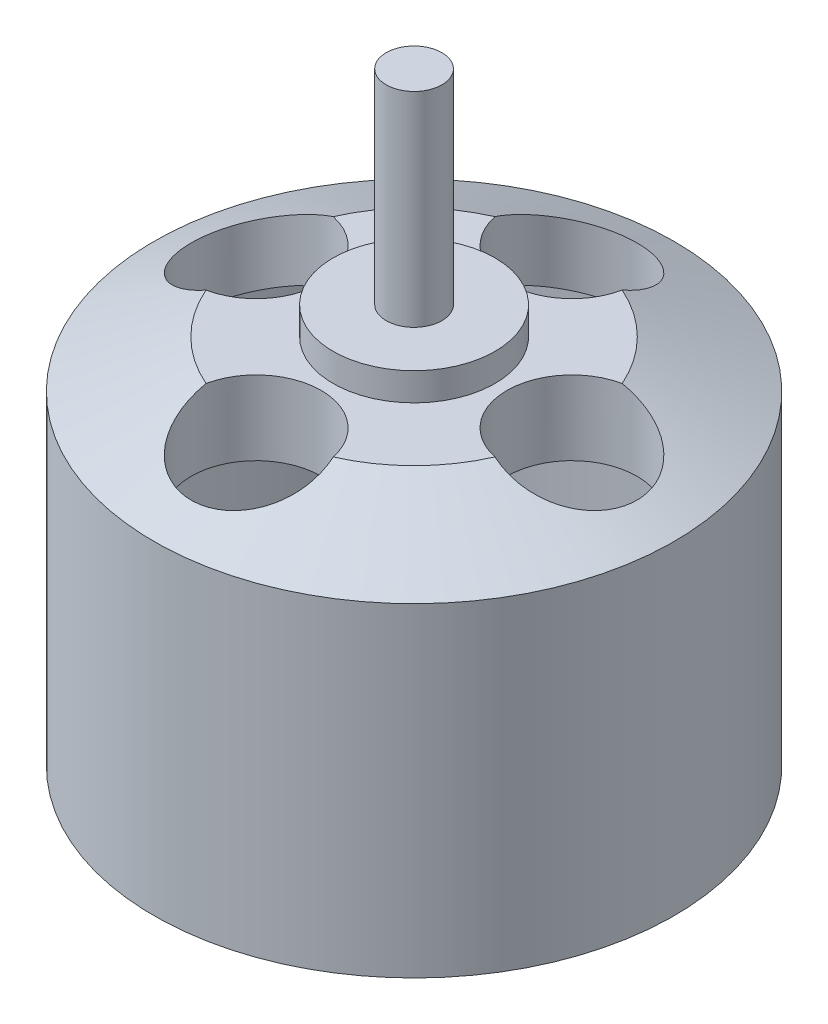
ISO-10303-21;
HEADER;
FILE_DESCRIPTION(('STEP AP214'),'2;1');
FILE_NAME('part.step','',(''),(''),'','','');
FILE_SCHEMA(('AUTOMOTIVE_DESIGN { 1 0 10303 214 1 1 1 1 }'));
ENDSEC;
DATA;
#1=APPLICATION_CONTEXT('core data for automotive mechanical design processes');
#2=APPLICATION_PROTOCOL_DEFINITION('international standard','automotive_design',2000,#1);
#3=PRODUCT_CONTEXT('',#1,'mechanical');
#4=PRODUCT('Part','Part','',(#3));
#5=PRODUCT_RELATED_PRODUCT_CATEGORY('part','',(#4));
#6=PRODUCT_DEFINITION_FORMATION('','',#4);
#7=PRODUCT_DEFINITION_CONTEXT('part definition',#1,'design');
#8=PRODUCT_DEFINITION('design','',#6,#7);
#9=PRODUCT_DEFINITION_SHAPE('','',#8);
#10=(LENGTH_UNIT() NAMED_UNIT(*) SI_UNIT(.MILLI.,.METRE.));
#11=(NAMED_UNIT(*) PLANE_ANGLE_UNIT() SI_UNIT($,.RADIAN.));
#12=(NAMED_UNIT(*) SI_UNIT($,.STERADIAN.) SOLID_ANGLE_UNIT());
#13=UNCERTAINTY_MEASURE_WITH_UNIT(LENGTH_MEASURE(1.E-05),#10,'distance_accuracy_value','');
#14=(GEOMETRIC_REPRESENTATION_CONTEXT(3) GLOBAL_UNCERTAINTY_ASSIGNED_CONTEXT((#13)) GLOBAL_UNIT_ASSIGNED_CONTEXT((#10,
#11,#12)) REPRESENTATION_CONTEXT('',''));
#15=CARTESIAN_POINT('',(0.,0.,0.));
#16=DIRECTION('',(0.,0.,1.));
#17=DIRECTION('',(1.,0.,0.));
#18=AXIS2_PLACEMENT_3D('',#15,#16,#17);
#19=CARTESIAN_POINT('',(0.,-16.,0.));
#20=DIRECTION('',(0.,-1.,0.));
#21=DIRECTION('',(0.,0.,-1.));
#22=AXIS2_PLACEMENT_3D('',#19,#20,#21);
#23=PLANE('',#22);
#24=CARTESIAN_POINT('',(0.,-16.,0.));
#25=DIRECTION('',(0.,-1.,0.));
#26=DIRECTION('',(0.,0.,-1.));
#27=AXIS2_PLACEMENT_3D('',#24,#25,#26);
#28=CIRCLE('',#27,14.);
#29=CARTESIAN_POINT('',(0.,-16.,-14.));
#30=VERTEX_POINT('',#29);
#31=EDGE_CURVE('E302',#30,#30,#28,.T.);
#32=ORIENTED_EDGE('',*,*,#31,.T.);
#33=EDGE_LOOP('',(#32));
#34=FACE_BOUND('',#33,.T.);
#35=CARTESIAN_POINT('',(0.,-16.,0.));
#36=DIRECTION('',(0.,-1.,0.));
#37=DIRECTION('',(0.,0.,-1.));
#38=AXIS2_PLACEMENT_3D('',#35,#36,#37);
#39=CIRCLE('',#38,13.24);
#40=CARTESIAN_POINT('',(0.,-16.,-13.24));
#41=VERTEX_POINT('',#40);
#42=EDGE_CURVE('E120',#41,#41,#39,.T.);
#43=ORIENTED_EDGE('',*,*,#42,.F.);
#44=EDGE_LOOP('',(#43));
#45=FACE_BOUND('',#44,.T.);
#46=ADVANCED_FACE('F41',(#34,#45),#23,.T.);
#47=CARTESIAN_POINT('',(0.,-19.4469995619799,0.));
#48=DIRECTION('',(0.,-1.,0.));
#49=DIRECTION('',(0.,0.,-1.));
#50=AXIS2_PLACEMENT_3D('',#47,#48,#49);
#51=CYLINDRICAL_SURFACE('',#50,13.24);
#52=ORIENTED_EDGE('',*,*,#42,.T.);
#53=EDGE_LOOP('',(#52));
#54=FACE_BOUND('',#53,.T.);
#55=CARTESIAN_POINT('',(0.,-1.5,0.));
#56=DIRECTION('',(0.,-1.,0.));
#57=DIRECTION('',(0.,0.,-1.));
#58=AXIS2_PLACEMENT_3D('',#55,#56,#57);
#59=CIRCLE('',#58,13.24);
#60=CARTESIAN_POINT('',(0.,-1.5,-13.24));
#61=VERTEX_POINT('',#60);
#62=EDGE_CURVE('E171',#61,#61,#59,.T.);
#63=ORIENTED_EDGE('',*,*,#62,.F.);
#64=EDGE_LOOP('',(#63));
#65=FACE_BOUND('',#64,.T.);
#66=ADVANCED_FACE('F216',(#54,#65),#51,.F.);
#67=CARTESIAN_POINT('',(0.,0.,0.));
#68=DIRECTION('',(0.,-1.,0.));
#69=DIRECTION('',(0.,0.,-1.));
#70=AXIS2_PLACEMENT_3D('',#67,#68,#69);
#71=CONICAL_SURFACE('',#70,10.,1.13721484284313);
#72=CARTESIAN_POINT('',(-3.37929158623575,0.000200000000003452,-9.41125648156611));
#73=CARTESIAN_POINT('',(-3.35362577634706,-0.0372705450020807,-9.50646778700696));
#74=CARTESIAN_POINT('',(-3.32384120358389,-0.073968704903637,-9.60088015161493));
#75=CARTESIAN_POINT('',(-3.25612758576577,-0.145676588500697,-9.78742693181489));
#76=CARTESIAN_POINT('',(-3.21819641294265,-0.180685868155294,-9.8795607452598));
#77=CARTESIAN_POINT('',(-3.13421912630061,-0.248915170060511,-10.0609862857074));
#78=CARTESIAN_POINT('',(-3.08815823538332,-0.282131787796258,-10.1502724817017));
#79=CARTESIAN_POINT('',(-2.98819466400165,-0.346540900559239,-10.3250599396943));
#80=CARTESIAN_POINT('',(-2.93429271790643,-0.377733584746693,-10.4105615551678));
#81=CARTESIAN_POINT('',(-2.76091583930015,-0.468182213917193,-10.6606581863167));
#82=CARTESIAN_POINT('',(-2.62986861558726,-0.524228548208502,-10.8186302455657));
#83=CARTESIAN_POINT('',(-2.34040485173376,-0.626392941394819,-11.1105057465168));
#84=CARTESIAN_POINT('',(-2.18201949466505,-0.672522178997262,-11.2444362598143));
#85=CARTESIAN_POINT('',(-1.85009598261013,-0.75204123719362,-11.477638516249));
#86=CARTESIAN_POINT('',(-1.67760938366938,-0.785924963047858,-11.5782356256371));
#87=CARTESIAN_POINT('',(-1.31653364392419,-0.843102591219234,-11.7490945798343));
#88=CARTESIAN_POINT('',(-1.12794388915905,-0.866396089551288,-11.8193552673957));
#89=CARTESIAN_POINT('',(-0.749821371871697,-0.901003143738591,-11.9240925330193));
#90=CARTESIAN_POINT('',(-0.560764226817224,-0.912835936020139,-11.9601185119658));
#91=CARTESIAN_POINT('',(-0.17897636761551,-0.92615464635899,-12.0006848801966));
#92=CARTESIAN_POINT('',(0.0137532463397586,-0.927643615813857,-12.0052345548974));
#93=CARTESIAN_POINT('',(0.392566635905904,-0.920337619480737,-11.9829643855682));
#94=CARTESIAN_POINT('',(0.578699454913781,-0.911786397212837,-11.9568880381974));
#95=CARTESIAN_POINT('',(0.943748726797481,-0.884978561161373,-11.8755457546804));
#96=CARTESIAN_POINT('',(1.12266470374324,-0.86672130841505,-11.8202778968143));
#97=CARTESIAN_POINT('',(1.46903805263986,-0.820783273261593,-11.6822660161879));
#98=CARTESIAN_POINT('',(1.63644979654087,-0.793067306160085,-11.5994194342811));
#99=CARTESIAN_POINT('',(1.95474639732037,-0.728772794580089,-11.4091835560685));
#100=CARTESIAN_POINT('',(2.10563278531062,-0.692195072173759,-11.3017965363404));
#101=CARTESIAN_POINT('',(2.39147614817749,-0.609655683445458,-11.0625337642482));
#102=CARTESIAN_POINT('',(2.52584274100427,-0.563452193653586,-10.9300370173085));
#103=CARTESIAN_POINT('',(2.77050500992041,-0.463166561738001,-10.6469380252733));
#104=CARTESIAN_POINT('',(2.88078497910145,-0.409079316707625,-10.4963240645938));
#105=CARTESIAN_POINT('',(3.06785527360667,-0.298274915674711,-10.1933743912214));
#106=CARTESIAN_POINT('',(3.14654271864794,-0.242062884605244,-10.0420232567734));
#107=CARTESIAN_POINT('',(3.24702151458333,-0.153931996883692,-9.80919907976748));
#108=CARTESIAN_POINT('',(3.27757677849726,-0.123937518697892,-9.73067061501232));
#109=CARTESIAN_POINT('',(3.33283140636791,-0.0627494941345356,-9.57204596127093));
#110=CARTESIAN_POINT('',(3.35753139055831,-0.0315560751646406,-9.49194993930562));
#111=CARTESIAN_POINT('',(3.37929158623575,0.000200000000003806,-9.41125648156611));
#112=B_SPLINE_CURVE_WITH_KNOTS('',3,(#72,#73,#74,#75,#76,#77,#78,#79,#80,#81,#82,#83,#84,#85,
#86,#87,#88,#89,#90,#91,#92,#93,#94,#95,#96,#97,#98,#99,#100,#101,#102,#103,#104,#105,#106,#107,
#108,#109,#110,#111),.UNSPECIFIED.,.F.,.F.,(4,2,2,2,2,2,2,2,2,2,2,2,2,2,2,2,2,2,2,4),(0.,
0.316390238063851,0.632863213163631,0.949917467898088,1.26694204739982,1.90173031008292,
2.53579923347743,3.14028892114745,3.74480166633261,4.32043003869978,4.89588859516248,
5.45766085762286,6.01947010698672,6.58339238448404,7.14726236902127,7.72751960756827,
8.30815411006881,8.84504457949854,9.1131880522922,9.3813031086811),.UNSPECIFIED.);
#113=CARTESIAN_POINT('',(-3.37915449796355,0.,-9.41176470588235));
#114=VERTEX_POINT('',#113);
#115=CARTESIAN_POINT('',(3.37915449796355,0.,-9.41176470588235));
#116=VERTEX_POINT('',#115);
#117=EDGE_CURVE('E284',#114,#116,#112,.T.);
#118=ORIENTED_EDGE('',*,*,#117,.F.);
#119=CARTESIAN_POINT('',(0.,0.,0.));
#120=DIRECTION('',(0.,-1.,0.));
#121=DIRECTION('',(0.,0.,-1.));
#122=AXIS2_PLACEMENT_3D('',#119,#120,#121);
#123=CIRCLE('',#122,10.);
#124=CARTESIAN_POINT('',(-9.41176470588235,0.,-3.37915449796355));
#125=VERTEX_POINT('',#124);
#126=EDGE_CURVE('E166',#125,#114,#123,.T.);
#127=ORIENTED_EDGE('',*,*,#126,.F.);
#128=CARTESIAN_POINT('',(-9.41125648156611,0.000200000000003452,3.37929158623575));
#129=CARTESIAN_POINT('',(-9.50646778700696,-0.0372705450020806,3.35362577634707));
#130=CARTESIAN_POINT('',(-9.60088015161493,-0.073968704903637,3.32384120358389));
#131=CARTESIAN_POINT('',(-9.78742693181489,-0.145676588500697,3.25612758576577));
#132=CARTESIAN_POINT('',(-9.8795607452598,-0.180685868155294,3.21819641294265));
#133=CARTESIAN_POINT('',(-10.0609862857074,-0.248915170060511,3.13421912630061));
#134=CARTESIAN_POINT('',(-10.1502724817017,-0.282131787796258,3.08815823538332));
#135=CARTESIAN_POINT('',(-10.3250599396943,-0.346540900559238,2.98819466400166));
#136=CARTESIAN_POINT('',(-10.4105615551678,-0.377733584746692,2.93429271790643));
#137=CARTESIAN_POINT('',(-10.6606581863167,-0.468182213917193,2.76091583930015));
#138=CARTESIAN_POINT('',(-10.8186302455657,-0.524228548208502,2.62986861558726));
#139=CARTESIAN_POINT('',(-11.1105057465168,-0.626392941394819,2.34040485173376));
#140=CARTESIAN_POINT('',(-11.2444362598143,-0.672522178997261,2.18201949466505));
#141=CARTESIAN_POINT('',(-11.477638516249,-0.752041237193619,1.85009598261013));
#142=CARTESIAN_POINT('',(-11.5782356256371,-0.785924963047858,1.67760938366939));
#143=CARTESIAN_POINT('',(-11.7490945798343,-0.843102591219234,1.31653364392419));
#144=CARTESIAN_POINT('',(-11.8193552673957,-0.866396089551288,1.12794388915905));
#145=CARTESIAN_POINT('',(-11.9240925330193,-0.901003143738591,0.749821371871699));
#146=CARTESIAN_POINT('',(-11.9601185119658,-0.912835936020139,0.560764226817226));
#147=CARTESIAN_POINT('',(-12.0006848801966,-0.92615464635899,0.178976367615511));
#148=CARTESIAN_POINT('',(-12.0052345548974,-0.927643615813857,-0.013753246339757));
#149=CARTESIAN_POINT('',(-11.9829643855682,-0.920337619480737,-0.392566635905902));
#150=CARTESIAN_POINT('',(-11.9568880381974,-0.911786397212837,-0.578699454913778));
#151=CARTESIAN_POINT('',(-11.8755457546804,-0.884978561161374,-0.943748726797479));
#152=CARTESIAN_POINT('',(-11.8202778968143,-0.866721308415051,-1.12266470374324));
#153=CARTESIAN_POINT('',(-11.6822660161879,-0.820783273261593,-1.46903805263986));
#154=CARTESIAN_POINT('',(-11.5994194342811,-0.793067306160086,-1.63644979654087));
#155=CARTESIAN_POINT('',(-11.4091835560685,-0.728772794580089,-1.95474639732036));
#156=CARTESIAN_POINT('',(-11.3017965363404,-0.692195072173759,-2.10563278531062));
#157=CARTESIAN_POINT('',(-11.0625337642482,-0.609655683445459,-2.39147614817749));
#158=CARTESIAN_POINT('',(-10.9300370173085,-0.563452193653587,-2.52584274100427));
#159=CARTESIAN_POINT('',(-10.6469380252733,-0.463166561738002,-2.77050500992041));
#160=CARTESIAN_POINT('',(-10.4963240645938,-0.409079316707626,-2.88078497910145));
#161=CARTESIAN_POINT('',(-10.1933743912214,-0.298274915674712,-3.06785527360667));
#162=CARTESIAN_POINT('',(-10.0420232567734,-0.242062884605245,-3.14654271864794));
#163=CARTESIAN_POINT('',(-9.80919907976748,-0.153931996883693,-3.24702151458333));
#164=CARTESIAN_POINT('',(-9.73067061501232,-0.123937518697893,-3.27757677849725));
#165=CARTESIAN_POINT('',(-9.57204596127094,-0.0627494941345361,-3.33283140636791));
#166=CARTESIAN_POINT('',(-9.49194993930562,-0.0315560751646409,-3.35753139055831));
#167=CARTESIAN_POINT('',(-9.41125648156611,0.000200000000003807,-3.37929158623575));
#168=B_SPLINE_CURVE_WITH_KNOTS('',3,(#128,#129,#130,#131,#132,#133,#134,#135,#136,#137,#138,
#139,#140,#141,#142,#143,#144,#145,#146,#147,#148,#149,#150,#151,#152,#153,#154,#155,#156,#157,
#158,#159,#160,#161,#162,#163,#164,#165,#166,#167),.UNSPECIFIED.,.F.,.F.,(4,2,2,2,2,2,2,2,2,2,2,
2,2,2,2,2,2,2,2,4),(0.,0.316390238063851,0.632863213163629,0.949917467898086,1.26694204739982,
1.90173031008292,2.53579923347743,3.14028892114745,3.74480166633261,4.32043003869978,
4.89588859516248,5.45766085762285,6.01947010698672,6.58339238448404,7.14726236902127,
7.72751960756828,8.30815411006881,8.84504457949854,9.11318805229221,9.38130310868111),.UNSPECIFIED.);
#169=CARTESIAN_POINT('',(-9.41176470588235,0.,3.37915449796355));
#170=VERTEX_POINT('',#169);
#171=EDGE_CURVE('E61',#170,#125,#168,.T.);
#172=ORIENTED_EDGE('',*,*,#171,.F.);
#173=CARTESIAN_POINT('',(-3.37915449796354,0.,9.41176470588236));
#174=VERTEX_POINT('',#173);
#175=EDGE_CURVE('E274',#174,#170,#123,.T.);
#176=ORIENTED_EDGE('',*,*,#175,.F.);
#177=CARTESIAN_POINT('',(3.37929158623576,0.000200000000002701,9.41125648156611));
#178=CARTESIAN_POINT('',(3.35362577634707,-0.0372705450020822,9.50646778700695));
#179=CARTESIAN_POINT('',(3.32384120358389,-0.0739687049036382,9.60088015161493));
#180=CARTESIAN_POINT('',(3.25612758576577,-0.145676588500697,9.78742693181489));
#181=CARTESIAN_POINT('',(3.21819641294266,-0.180685868155293,9.8795607452598));
#182=CARTESIAN_POINT('',(3.13421912630062,-0.24891517006051,10.0609862857074));
#183=CARTESIAN_POINT('',(3.08815823538332,-0.282131787796259,10.1502724817017));
#184=CARTESIAN_POINT('',(2.98819466400166,-0.346540900559239,10.3250599396943));
#185=CARTESIAN_POINT('',(2.93429271790644,-0.377733584746693,10.4105615551678));
#186=CARTESIAN_POINT('',(2.76091583930016,-0.468182213917193,10.6606581863167));
#187=CARTESIAN_POINT('',(2.62986861558726,-0.524228548208503,10.8186302455657));
#188=CARTESIAN_POINT('',(2.34040485173376,-0.62639294139482,11.1105057465168));
#189=CARTESIAN_POINT('',(2.18201949466505,-0.672522178997261,11.2444362598143));
#190=CARTESIAN_POINT('',(1.85009598261014,-0.752041237193619,11.477638516249));
#191=CARTESIAN_POINT('',(1.67760938366939,-0.785924963047858,11.5782356256371));
#192=CARTESIAN_POINT('',(1.31653364392419,-0.843102591219235,11.7490945798343));
#193=CARTESIAN_POINT('',(1.12794388915906,-0.866396089551289,11.8193552673957));
#194=CARTESIAN_POINT('',(0.749821371871705,-0.901003143738591,11.9240925330193));
#195=CARTESIAN_POINT('',(0.560764226817232,-0.91283593602014,11.9601185119658));
#196=CARTESIAN_POINT('',(0.178976367615517,-0.926154646358991,12.0006848801966));
#197=CARTESIAN_POINT('',(-0.0137532463397507,-0.927643615813858,12.0052345548974));
#198=CARTESIAN_POINT('',(-0.392566635905897,-0.920337619480738,11.9829643855682));
#199=CARTESIAN_POINT('',(-0.578699454913773,-0.911786397212838,11.9568880381974));
#200=CARTESIAN_POINT('',(-0.943748726797474,-0.884978561161374,11.8755457546804));
#201=CARTESIAN_POINT('',(-1.12266470374323,-0.866721308415051,11.8202778968143));
#202=CARTESIAN_POINT('',(-1.46903805263985,-0.820783273261594,11.6822660161879));
#203=CARTESIAN_POINT('',(-1.63644979654086,-0.793067306160087,11.5994194342811));
#204=CARTESIAN_POINT('',(-1.95474639732036,-0.728772794580091,11.4091835560685));
#205=CARTESIAN_POINT('',(-2.10563278531061,-0.69219507217376,11.3017965363404));
#206=CARTESIAN_POINT('',(-2.39147614817748,-0.60965568344546,11.0625337642482));
#207=CARTESIAN_POINT('',(-2.52584274100426,-0.563452193653588,10.9300370173085));
#208=CARTESIAN_POINT('',(-2.77050500992041,-0.463166561738003,10.6469380252733));
#209=CARTESIAN_POINT('',(-2.88078497910145,-0.409079316707628,10.4963240645938));
#210=CARTESIAN_POINT('',(-3.06785527360666,-0.298274915674713,10.1933743912214));
#211=CARTESIAN_POINT('',(-3.14654271864794,-0.242062884605245,10.0420232567734));
#212=CARTESIAN_POINT('',(-3.24702151458332,-0.153931996883692,9.80919907976748));
#213=CARTESIAN_POINT('',(-3.27757677849725,-0.123937518697893,9.73067061501232));
#214=CARTESIAN_POINT('',(-3.33283140636791,-0.0627494941345367,9.57204596127094));
#215=CARTESIAN_POINT('',(-3.35753139055831,-0.031556075164642,9.49194993930562));
#216=CARTESIAN_POINT('',(-3.37929158623575,0.000200000000002309,9.41125648156611));
#217=B_SPLINE_CURVE_WITH_KNOTS('',3,(#177,#178,#179,#180,#181,#182,#183,#184,#185,#186,#187,
#188,#189,#190,#191,#192,#193,#194,#195,#196,#197,#198,#199,#200,#201,#202,#203,#204,#205,#206,
#207,#208,#209,#210,#211,#212,#213,#214,#215,#216),.UNSPECIFIED.,.F.,.F.,(4,2,2,2,2,2,2,2,2,2,2,
2,2,2,2,2,2,2,2,4),(0.,0.31639023806385,0.632863213163628,0.949917467898086,1.26694204739982,
1.90173031008292,2.53579923347743,3.14028892114744,3.7448016663326,4.32043003869977,
4.89588859516248,5.45766085762285,6.01947010698672,6.58339238448404,7.14726236902126,
7.72751960756827,8.30815411006881,8.84504457949854,9.11318805229221,9.38130310868111),.UNSPECIFIED.);
#218=CARTESIAN_POINT('',(3.37915449796355,0.,9.41176470588235));
#219=VERTEX_POINT('',#218);
#220=EDGE_CURVE('E68',#219,#174,#217,.T.);
#221=ORIENTED_EDGE('',*,*,#220,.F.);
#222=CARTESIAN_POINT('',(9.41176470588235,0.,3.37915449796355));
#223=VERTEX_POINT('',#222);
#224=EDGE_CURVE('E172',#223,#219,#123,.T.);
#225=ORIENTED_EDGE('',*,*,#224,.F.);
#226=CARTESIAN_POINT('',(9.41125648156611,0.000200000000002751,-3.37929158623575));
#227=CARTESIAN_POINT('',(9.50646778700696,-0.0372705450020807,-3.35362577634706));
#228=CARTESIAN_POINT('',(9.60088015161493,-0.0739687049036365,-3.32384120358389));
#229=CARTESIAN_POINT('',(9.78742693181489,-0.145676588500696,-3.25612758576577));
#230=CARTESIAN_POINT('',(9.8795607452598,-0.180685868155293,-3.21819641294265));
#231=CARTESIAN_POINT('',(10.0609862857074,-0.24891517006051,-3.13421912630061));
#232=CARTESIAN_POINT('',(10.1502724817017,-0.282131787796258,-3.08815823538332));
#233=CARTESIAN_POINT('',(10.3250599396943,-0.346540900559239,-2.98819466400165));
#234=CARTESIAN_POINT('',(10.4105615551678,-0.377733584746693,-2.93429271790643));
#235=CARTESIAN_POINT('',(10.6606581863167,-0.468182213917193,-2.76091583930015));
#236=CARTESIAN_POINT('',(10.8186302455657,-0.524228548208503,-2.62986861558726));
#237=CARTESIAN_POINT('',(11.1105057465168,-0.62639294139482,-2.34040485173376));
#238=CARTESIAN_POINT('',(11.2444362598143,-0.672522178997261,-2.18201949466505));
#239=CARTESIAN_POINT('',(11.477638516249,-0.752041237193619,-1.85009598261013));
#240=CARTESIAN_POINT('',(11.5782356256371,-0.785924963047858,-1.67760938366938));
#241=CARTESIAN_POINT('',(11.7490945798343,-0.843102591219235,-1.31653364392418));
#242=CARTESIAN_POINT('',(11.8193552673957,-0.866396089551289,-1.12794388915905));
#243=CARTESIAN_POINT('',(11.9240925330193,-0.901003143738592,-0.749821371871694));
#244=CARTESIAN_POINT('',(11.9601185119658,-0.91283593602014,-0.560764226817221));
#245=CARTESIAN_POINT('',(12.0006848801966,-0.926154646358991,-0.178976367615507));
#246=CARTESIAN_POINT('',(12.0052345548974,-0.927643615813858,0.013753246339761));
#247=CARTESIAN_POINT('',(11.9829643855682,-0.920337619480738,0.392566635905906));
#248=CARTESIAN_POINT('',(11.9568880381974,-0.911786397212838,0.578699454913782));
#249=CARTESIAN_POINT('',(11.8755457546804,-0.884978561161375,0.943748726797483));
#250=CARTESIAN_POINT('',(11.8202778968143,-0.866721308415052,1.12266470374324));
#251=CARTESIAN_POINT('',(11.6822660161879,-0.820783273261594,1.46903805263986));
#252=CARTESIAN_POINT('',(11.5994194342811,-0.793067306160087,1.63644979654087));
#253=CARTESIAN_POINT('',(11.4091835560685,-0.728772794580091,1.95474639732037));
#254=CARTESIAN_POINT('',(11.3017965363404,-0.692195072173761,2.10563278531062));
#255=CARTESIAN_POINT('',(11.0625337642482,-0.609655683445461,2.39147614817749));
#256=CARTESIAN_POINT('',(10.9300370173085,-0.563452193653588,2.52584274100427));
#257=CARTESIAN_POINT('',(10.6469380252733,-0.463166561738003,2.77050500992042));
#258=CARTESIAN_POINT('',(10.4963240645938,-0.409079316707628,2.88078497910145));
#259=CARTESIAN_POINT('',(10.1933743912214,-0.298274915674714,3.06785527360667));
#260=CARTESIAN_POINT('',(10.0420232567734,-0.242062884605247,3.14654271864795));
#261=CARTESIAN_POINT('',(9.80919907976748,-0.153931996883693,3.24702151458333));
#262=CARTESIAN_POINT('',(9.73067061501232,-0.123937518697893,3.27757677849726));
#263=CARTESIAN_POINT('',(9.57204596127093,-0.0627494941345355,3.33283140636792));
#264=CARTESIAN_POINT('',(9.49194993930562,-0.0315560751646405,3.35753139055832));
#265=CARTESIAN_POINT('',(9.41125648156611,0.00020000000000366,3.37929158623576));
#266=B_SPLINE_CURVE_WITH_KNOTS('',3,(#226,#227,#228,#229,#230,#231,#232,#233,#234,#235,#236,
#237,#238,#239,#240,#241,#242,#243,#244,#245,#246,#247,#248,#249,#250,#251,#252,#253,#254,#255,
#256,#257,#258,#259,#260,#261,#262,#263,#264,#265),.UNSPECIFIED.,.F.,.F.,(4,2,2,2,2,2,2,2,2,2,2,
2,2,2,2,2,2,2,2,4),(0.,0.316390238063849,0.632863213163628,0.949917467898086,1.26694204739982,
1.90173031008292,2.53579923347743,3.14028892114745,3.74480166633261,4.32043003869978,
4.89588859516248,5.45766085762285,6.01947010698672,6.58339238448404,7.14726236902127,
7.72751960756827,8.30815411006881,8.84504457949854,9.11318805229221,9.38130310868111),.UNSPECIFIED.);
#267=CARTESIAN_POINT('',(9.41176470588235,0.,-3.37915449796354));
#268=VERTEX_POINT('',#267);
#269=EDGE_CURVE('E229',#268,#223,#266,.T.);
#270=ORIENTED_EDGE('',*,*,#269,.F.);
#271=EDGE_CURVE('E167',#116,#268,#123,.T.);
#272=ORIENTED_EDGE('',*,*,#271,.F.);
#273=EDGE_LOOP('',(#118,#127,#172,#176,#221,#225,#270,#272));
#274=FACE_BOUND('',#273,.T.);
#275=ORIENTED_EDGE('',*,*,#62,.T.);
#276=EDGE_LOOP('',(#275));
#277=FACE_BOUND('',#276,.T.);
#278=ADVANCED_FACE('F211',(#274,#277),#71,.F.);
#279=CARTESIAN_POINT('',(0.,0.,0.));
#280=DIRECTION('',(0.,-1.,0.));
#281=DIRECTION('',(0.,0.,-1.));
#282=AXIS2_PLACEMENT_3D('',#279,#280,#281);
#283=PLANE('',#282);
#284=CARTESIAN_POINT('',(0.,0.,-8.5));
#285=DIRECTION('',(0.,-1.,0.));
#286=DIRECTION('',(0.,0.,-1.));
#287=AXIS2_PLACEMENT_3D('',#284,#285,#286);
#288=CIRCLE('',#287,3.5);
#289=EDGE_CURVE('E236',#116,#114,#288,.T.);
#290=ORIENTED_EDGE('',*,*,#289,.F.);
#291=ORIENTED_EDGE('',*,*,#271,.T.);
#292=CARTESIAN_POINT('',(8.5,0.,0.));
#293=DIRECTION('',(0.,-1.,0.));
#294=DIRECTION('',(0.,0.,-1.));
#295=AXIS2_PLACEMENT_3D('',#292,#293,#294);
#296=CIRCLE('',#295,3.5);
#297=EDGE_CURVE('E237',#223,#268,#296,.T.);
#298=ORIENTED_EDGE('',*,*,#297,.F.);
#299=ORIENTED_EDGE('',*,*,#224,.T.);
#300=CARTESIAN_POINT('',(0.,0.,8.5));
#301=DIRECTION('',(0.,-1.,0.));
#302=DIRECTION('',(0.,0.,-1.));
#303=AXIS2_PLACEMENT_3D('',#300,#301,#302);
#304=CIRCLE('',#303,3.5);
#305=EDGE_CURVE('E208',#174,#219,#304,.T.);
#306=ORIENTED_EDGE('',*,*,#305,.F.);
#307=ORIENTED_EDGE('',*,*,#175,.T.);
#308=CARTESIAN_POINT('',(-8.5,0.,0.));
#309=DIRECTION('',(0.,-1.,0.));
#310=DIRECTION('',(0.,0.,-1.));
#311=AXIS2_PLACEMENT_3D('',#308,#309,#310);
#312=CIRCLE('',#311,3.5);
#313=EDGE_CURVE('E209',#125,#170,#312,.T.);
#314=ORIENTED_EDGE('',*,*,#313,.F.);
#315=ORIENTED_EDGE('',*,*,#126,.T.);
#316=EDGE_LOOP('',(#290,#291,#298,#299,#306,#307,#314,#315));
#317=FACE_BOUND('',#316,.T.);
#318=ADVANCED_FACE('F215',(#317),#283,.T.);
#319=CARTESIAN_POINT('',(0.,16.5,0.));
#320=DIRECTION('',(0.,-1.,0.));
#321=DIRECTION('',(0.,0.,-1.));
#322=AXIS2_PLACEMENT_3D('',#319,#320,#321);
#323=PLANE('',#322);
#324=CARTESIAN_POINT('',(0.,16.5,0.));
#325=DIRECTION('',(0.,-1.,0.));
#326=DIRECTION('',(0.,0.,-1.));
#327=AXIS2_PLACEMENT_3D('',#324,#325,#326);
#328=CIRCLE('',#327,1.5);
#329=CARTESIAN_POINT('',(0.,16.5,-1.5));
#330=VERTEX_POINT('',#329);
#331=EDGE_CURVE('E162',#330,#330,#328,.T.);
#332=ORIENTED_EDGE('',*,*,#331,.F.);
#333=EDGE_LOOP('',(#332));
#334=FACE_BOUND('',#333,.T.);
#335=ADVANCED_FACE('F360',(#334),#323,.F.);
#336=CARTESIAN_POINT('',(0.,-19.4469995619799,0.));
#337=DIRECTION('',(0.,-1.,0.));
#338=DIRECTION('',(0.,0.,-1.));
#339=AXIS2_PLACEMENT_3D('',#336,#337,#338);
#340=CYLINDRICAL_SURFACE('',#339,1.5);
#341=CARTESIAN_POINT('',(0.,5.5,0.));
#342=DIRECTION('',(0.,-1.,0.));
#343=DIRECTION('',(0.,0.,-1.));
#344=AXIS2_PLACEMENT_3D('',#341,#342,#343);
#345=CIRCLE('',#344,1.5);
#346=CARTESIAN_POINT('',(0.,5.5,-1.5));
#347=VERTEX_POINT('',#346);
#348=EDGE_CURVE('E158',#347,#347,#345,.T.);
#349=ORIENTED_EDGE('',*,*,#348,.F.);
#350=EDGE_LOOP('',(#349));
#351=FACE_BOUND('',#350,.T.);
#352=ORIENTED_EDGE('',*,*,#331,.T.);
#353=EDGE_LOOP('',(#352));
#354=FACE_BOUND('',#353,.T.);
#355=ADVANCED_FACE('F391',(#351,#354),#340,.T.);
#356=CARTESIAN_POINT('',(0.,5.5,0.));
#357=DIRECTION('',(0.,1.,0.));
#358=DIRECTION('',(0.,0.,1.));
#359=AXIS2_PLACEMENT_3D('',#356,#357,#358);
#360=PLANE('',#359);
#361=ORIENTED_EDGE('',*,*,#348,.T.);
#362=EDGE_LOOP('',(#361));
#363=FACE_BOUND('',#362,.T.);
#364=CARTESIAN_POINT('',(0.,5.5,0.));
#365=DIRECTION('',(0.,-1.,0.));
#366=DIRECTION('',(0.,0.,-1.));
#367=AXIS2_PLACEMENT_3D('',#364,#365,#366);
#368=CIRCLE('',#367,4.36);
#369=CARTESIAN_POINT('',(0.,5.5,-4.36));
#370=VERTEX_POINT('',#369);
#371=EDGE_CURVE('E154',#370,#370,#368,.T.);
#372=ORIENTED_EDGE('',*,*,#371,.F.);
#373=EDGE_LOOP('',(#372));
#374=FACE_BOUND('',#373,.T.);
#375=ADVANCED_FACE('F381',(#363,#374),#360,.T.);
#376=CARTESIAN_POINT('',(0.,-19.4469995619799,0.));
#377=DIRECTION('',(0.,-1.,0.));
#378=DIRECTION('',(0.,0.,-1.));
#379=AXIS2_PLACEMENT_3D('',#376,#377,#378);
#380=CYLINDRICAL_SURFACE('',#379,4.36);
#381=ORIENTED_EDGE('',*,*,#371,.T.);
#382=EDGE_LOOP('',(#381));
#383=FACE_BOUND('',#382,.T.);
#384=CARTESIAN_POINT('',(0.,4.,0.));
#385=DIRECTION('',(0.,-1.,0.));
#386=DIRECTION('',(0.,0.,-1.));
#387=AXIS2_PLACEMENT_3D('',#384,#385,#386);
#388=CIRCLE('',#387,4.36);
#389=CARTESIAN_POINT('',(0.,4.,-4.36));
#390=VERTEX_POINT('',#389);
#391=EDGE_CURVE('E149',#390,#390,#388,.T.);
#392=ORIENTED_EDGE('',*,*,#391,.F.);
#393=EDGE_LOOP('',(#392));
#394=FACE_BOUND('',#393,.T.);
#395=ADVANCED_FACE('F350',(#383,#394),#380,.T.);
#396=CARTESIAN_POINT('',(0.,4.,0.));
#397=DIRECTION('',(0.,1.,0.));
#398=DIRECTION('',(0.,0.,1.));
#399=AXIS2_PLACEMENT_3D('',#396,#397,#398);
#400=PLANE('',#399);
#401=CARTESIAN_POINT('',(0.,4.,-8.5));
#402=DIRECTION('',(0.,1.,0.));
#403=DIRECTION('',(0.,0.,1.));
#404=AXIS2_PLACEMENT_3D('',#401,#402,#403);
#405=CIRCLE('',#404,3.5);
#406=CARTESIAN_POINT('',(-3.42501862697938,4.,-7.77941176470588));
#407=VERTEX_POINT('',#406);
#408=CARTESIAN_POINT('',(3.42501862697938,4.,-7.77941176470588));
#409=VERTEX_POINT('',#408);
#410=EDGE_CURVE('E260',#407,#409,#405,.T.);
#411=ORIENTED_EDGE('',*,*,#410,.F.);
#412=CARTESIAN_POINT('',(0.,4.,0.));
#413=DIRECTION('',(0.,-1.,0.));
#414=DIRECTION('',(0.,0.,-1.));
#415=AXIS2_PLACEMENT_3D('',#412,#413,#414);
#416=CIRCLE('',#415,8.5);
#417=CARTESIAN_POINT('',(-7.77941176470588,4.,-3.42501862697938));
#418=VERTEX_POINT('',#417);
#419=EDGE_CURVE('E129',#418,#407,#416,.T.);
#420=ORIENTED_EDGE('',*,*,#419,.F.);
#421=CARTESIAN_POINT('',(-8.5,4.,0.));
#422=DIRECTION('',(0.,1.,0.));
#423=DIRECTION('',(0.,0.,1.));
#424=AXIS2_PLACEMENT_3D('',#421,#422,#423);
#425=CIRCLE('',#424,3.5);
#426=CARTESIAN_POINT('',(-7.77941176470588,4.,3.42501862697938));
#427=VERTEX_POINT('',#426);
#428=EDGE_CURVE('E113',#427,#418,#425,.T.);
#429=ORIENTED_EDGE('',*,*,#428,.F.);
#430=CARTESIAN_POINT('',(-3.42501862697937,4.,7.77941176470588));
#431=VERTEX_POINT('',#430);
#432=EDGE_CURVE('E128',#431,#427,#416,.T.);
#433=ORIENTED_EDGE('',*,*,#432,.F.);
#434=CARTESIAN_POINT('',(0.,4.,8.5));
#435=DIRECTION('',(0.,1.,0.));
#436=DIRECTION('',(0.,0.,1.));
#437=AXIS2_PLACEMENT_3D('',#434,#435,#436);
#438=CIRCLE('',#437,3.5);
#439=CARTESIAN_POINT('',(3.42501862697938,4.,7.77941176470588));
#440=VERTEX_POINT('',#439);
#441=EDGE_CURVE('E131',#440,#431,#438,.T.);
#442=ORIENTED_EDGE('',*,*,#441,.F.);
#443=CARTESIAN_POINT('',(7.77941176470588,4.,3.42501862697938));
#444=VERTEX_POINT('',#443);
#445=EDGE_CURVE('E139',#444,#440,#416,.T.);
#446=ORIENTED_EDGE('',*,*,#445,.F.);
#447=CARTESIAN_POINT('',(8.5,4.,0.));
#448=DIRECTION('',(0.,1.,0.));
#449=DIRECTION('',(0.,0.,1.));
#450=AXIS2_PLACEMENT_3D('',#447,#448,#449);
#451=CIRCLE('',#450,3.5);
#452=CARTESIAN_POINT('',(7.77941176470588,4.,-3.42501862697937));
#453=VERTEX_POINT('',#452);
#454=EDGE_CURVE('E257',#453,#444,#451,.T.);
#455=ORIENTED_EDGE('',*,*,#454,.F.);
#456=EDGE_CURVE('E143',#409,#453,#416,.T.);
#457=ORIENTED_EDGE('',*,*,#456,.F.);
#458=EDGE_LOOP('',(#411,#420,#429,#433,#442,#446,#455,#457));
#459=FACE_BOUND('',#458,.T.);
#460=ORIENTED_EDGE('',*,*,#391,.T.);
#461=EDGE_LOOP('',(#460));
#462=FACE_BOUND('',#461,.T.);
#463=ADVANCED_FACE('F125',(#459,#462),#400,.T.);
#464=CARTESIAN_POINT('',(0.,1.4537037037037,0.));
#465=DIRECTION('',(0.,-1.,0.));
#466=DIRECTION('',(0.,0.,-1.));
#467=AXIS2_PLACEMENT_3D('',#464,#465,#466);
#468=CONICAL_SURFACE('',#467,14.,1.13721484284313);
#469=CARTESIAN_POINT('',(3.42492771254036,4.00019999999999,-7.77897977568377));
#470=CARTESIAN_POINT('',(3.44641993168907,3.95294273577824,-7.88103889812462));
#471=CARTESIAN_POINT('',(3.46336997843545,3.90602901632261,-7.9842173265615));
#472=CARTESIAN_POINT('',(3.48800032163115,3.81310516469844,-8.19210133450659));
#473=CARTESIAN_POINT('',(3.49567868488662,3.76709522293885,-8.29680722789465));
#474=CARTESIAN_POINT('',(3.50157683564182,3.67612743353909,-8.5071947941705));
#475=CARTESIAN_POINT('',(3.49977830109843,3.63117179279927,-8.61287796260486));
#476=CARTESIAN_POINT('',(3.48656423061673,3.54264040073119,-8.82417812895916));
#477=CARTESIAN_POINT('',(3.47514941407757,3.49906454643339,-8.92979513123754));
#478=CARTESIAN_POINT('',(3.42625849721585,3.37055825134051,-9.2457314707472));
#479=CARTESIAN_POINT('',(3.37413011233298,3.28793219203141,-9.4549427905366));
#480=CARTESIAN_POINT('',(3.23110297322308,3.13078360035854,-9.86257654312532));
#481=CARTESIAN_POINT('',(3.14024609022358,3.05625242511082,-10.0610103675286));
#482=CARTESIAN_POINT('',(2.92667056262627,2.92012061834792,-10.4307852572419));
#483=CARTESIAN_POINT('',(2.80571391938204,2.85806775311542,-10.6029741304781));
#484=CARTESIAN_POINT('',(2.53282794671017,2.74389850955773,-10.9247152085152));
#485=CARTESIAN_POINT('',(2.38090168182425,2.69178114906972,-11.074269650515));
#486=CARTESIAN_POINT('',(2.06094825770204,2.60166872783477,-11.3359200971057));
#487=CARTESIAN_POINT('',(1.8945749847898,2.56298307392582,-11.4498014533747));
#488=CARTESIAN_POINT('',(1.54312046421479,2.4962093186748,-11.6479235351229));
#489=CARTESIAN_POINT('',(1.35804727751501,2.468116675512,-11.7321769627179));
#490=CARTESIAN_POINT('',(0.984933075954371,2.42434252753923,-11.864076029061));
#491=CARTESIAN_POINT('',(0.797553028319418,2.40808896500794,-11.9134052011126));
#492=CARTESIAN_POINT('',(0.416630098370961,2.38602087300522,-11.9804877007934));
#493=CARTESIAN_POINT('',(0.223088361123714,2.38020441533192,-11.9982468608157));
#494=CARTESIAN_POINT('',(-0.158589313902803,2.37915155259105,-12.0014582243665));
#495=CARTESIAN_POINT('',(-0.346717354706702,2.38360991566004,-11.9878424770453));
#496=CARTESIAN_POINT('',(-0.717861271961891,2.40238355914161,-11.9307319677509));
#497=CARTESIAN_POINT('',(-0.90087744007121,2.41669827599938,-11.887238914067));
#498=CARTESIAN_POINT('',(-1.25634156715581,2.45485166738649,-11.7720708300181));
#499=CARTESIAN_POINT('',(-1.42880952609658,2.47867163032399,-11.7004511727596));
#500=CARTESIAN_POINT('',(-1.75903375730552,2.53536493850172,-11.5315352843808));
#501=CARTESIAN_POINT('',(-1.91678888482922,2.56823898741753,-11.4342370575691));
#502=CARTESIAN_POINT('',(-2.21736313620757,2.64333237765962,-11.214551037636));
#503=CARTESIAN_POINT('',(-2.35972613080846,2.68575940860493,-11.0916109932727));
#504=CARTESIAN_POINT('',(-2.62175803720335,2.77869673023021,-10.8261949697675));
#505=CARTESIAN_POINT('',(-2.74142332268821,2.8292083101687,-10.6837158752156));
#506=CARTESIAN_POINT('',(-2.96059815963833,2.93992607370627,-10.376705364265));
#507=CARTESIAN_POINT('',(-3.05894549389188,3.00046836178096,-10.2114662985012));
#508=CARTESIAN_POINT('',(-3.2266446993773,3.12843790815445,-9.86933813204812));
#509=CARTESIAN_POINT('',(-3.29598551956076,3.19586777836857,-9.69244462084404));
#510=CARTESIAN_POINT('',(-3.40810126560592,3.3406722137443,-9.32134392008155));
#511=CARTESIAN_POINT('',(-3.44907123857298,3.41839857368206,-9.1267306015141));
#512=CARTESIAN_POINT('',(-3.49761476781273,3.57903511191607,-8.73556491580239));
#513=CARTESIAN_POINT('',(-3.50520380492577,3.66194286917531,-8.53901348987735));
#514=CARTESIAN_POINT('',(-3.49228082655046,3.78819694271768,-8.24874298887738));
#515=CARTESIAN_POINT('',(-3.48412789766479,3.83015206221853,-8.15370943626662));
#516=CARTESIAN_POINT('',(-3.46019313262815,3.91470679992609,-7.96515179477285));
#517=CARTESIAN_POINT('',(-3.44442814781471,3.95730479411311,-7.87162484100663));
#518=CARTESIAN_POINT('',(-3.42492771254036,4.00019999999999,-7.77897977568377));
#519=B_SPLINE_CURVE_WITH_KNOTS('',3,(#469,#470,#471,#472,#473,#474,#475,#476,#477,#478,#479,
#480,#481,#482,#483,#484,#485,#486,#487,#488,#489,#490,#491,#492,#493,#494,#495,#496,#497,#498,
#499,#500,#501,#502,#503,#504,#505,#506,#507,#508,#509,#510,#511,#512,#513,#514,#515,#516,#517,
#518),.UNSPECIFIED.,.F.,.F.,(4,2,2,2,2,2,2,2,2,2,2,2,2,2,2,2,2,2,2,2,2,2,2,2,4),(0.,
0.343420644168312,0.6869128809562,1.03106944757924,1.37520026995353,2.06408537660447,
2.75222757824061,3.40694434323013,4.06159635335291,4.67432965962677,5.28679995306687,
5.86725119329712,6.4475951870773,7.01092208300464,7.57421677237447,8.13640801310846,
8.69864295918617,9.27454099897024,9.85053096999289,10.4526801241014,11.0550584795622,
11.692911090408,12.3304678576533,12.642825006527,12.9544938171475),.UNSPECIFIED.);
#520=EDGE_CURVE('E11',#409,#407,#519,.T.);
#521=ORIENTED_EDGE('',*,*,#520,.F.);
#522=ORIENTED_EDGE('',*,*,#456,.T.);
#523=CARTESIAN_POINT('',(7.77897977568377,4.00019999999999,3.42492771254037));
#524=CARTESIAN_POINT('',(7.88103889812462,3.95294273577824,3.44641993168908));
#525=CARTESIAN_POINT('',(7.9842173265615,3.90602901632261,3.46336997843545));
#526=CARTESIAN_POINT('',(8.19210133450659,3.81310516469844,3.48800032163116));
#527=CARTESIAN_POINT('',(8.29680722789465,3.76709522293884,3.49567868488662));
#528=CARTESIAN_POINT('',(8.5071947941705,3.67612743353909,3.50157683564183));
#529=CARTESIAN_POINT('',(8.61287796260486,3.63117179279927,3.49977830109844));
#530=CARTESIAN_POINT('',(8.82417812895916,3.54264040073119,3.48656423061674));
#531=CARTESIAN_POINT('',(8.92979513123754,3.49906454643339,3.47514941407758));
#532=CARTESIAN_POINT('',(9.2457314707472,3.37055825134051,3.42625849721585));
#533=CARTESIAN_POINT('',(9.4549427905366,3.2879321920314,3.37413011233298));
#534=CARTESIAN_POINT('',(9.86257654312532,3.13078360035854,3.23110297322309));
#535=CARTESIAN_POINT('',(10.0610103675286,3.05625242511082,3.14024609022359));
#536=CARTESIAN_POINT('',(10.4307852572419,2.92012061834792,2.92667056262627));
#537=CARTESIAN_POINT('',(10.6029741304781,2.85806775311542,2.80571391938205));
#538=CARTESIAN_POINT('',(10.9247152085152,2.74389850955773,2.53282794671018));
#539=CARTESIAN_POINT('',(11.074269650515,2.69178114906972,2.38090168182425));
#540=CARTESIAN_POINT('',(11.3359200971057,2.60166872783477,2.06094825770205));
#541=CARTESIAN_POINT('',(11.4498014533747,2.56298307392582,1.8945749847898));
#542=CARTESIAN_POINT('',(11.6479235351229,2.4962093186748,1.5431204642148));
#543=CARTESIAN_POINT('',(11.7321769627179,2.468116675512,1.35804727751501));
#544=CARTESIAN_POINT('',(11.864076029061,2.42434252753923,0.984933075954377));
#545=CARTESIAN_POINT('',(11.9134052011126,2.40808896500794,0.797553028319424));
#546=CARTESIAN_POINT('',(11.9804877007934,2.38602087300522,0.416630098370966));
#547=CARTESIAN_POINT('',(11.9982468608157,2.38020441533192,0.223088361123719));
#548=CARTESIAN_POINT('',(12.0014582243666,2.37915155259105,-0.158589313902798));
#549=CARTESIAN_POINT('',(11.9878424770453,2.38360991566004,-0.346717354706697));
#550=CARTESIAN_POINT('',(11.9307319677509,2.40238355914161,-0.717861271961886));
#551=CARTESIAN_POINT('',(11.887238914067,2.41669827599937,-0.900877440071205));
#552=CARTESIAN_POINT('',(11.7720708300181,2.45485166738649,-1.2563415671558));
#553=CARTESIAN_POINT('',(11.7004511727596,2.47867163032399,-1.42880952609657));
#554=CARTESIAN_POINT('',(11.5315352843808,2.53536493850172,-1.75903375730552));
#555=CARTESIAN_POINT('',(11.4342370575692,2.56823898741753,-1.91678888482922));
#556=CARTESIAN_POINT('',(11.214551037636,2.64333237765962,-2.21736313620757));
#557=CARTESIAN_POINT('',(11.0916109932727,2.68575940860493,-2.35972613080845));
#558=CARTESIAN_POINT('',(10.8261949697675,2.7786967302302,-2.62175803720335));
#559=CARTESIAN_POINT('',(10.6837158752156,2.8292083101687,-2.7414233226882));
#560=CARTESIAN_POINT('',(10.376705364265,2.93992607370627,-2.96059815963832));
#561=CARTESIAN_POINT('',(10.2114662985012,3.00046836178095,-3.05894549389188));
#562=CARTESIAN_POINT('',(9.86933813204812,3.12843790815445,-3.22664469937729));
#563=CARTESIAN_POINT('',(9.69244462084405,3.19586777836857,-3.29598551956075));
#564=CARTESIAN_POINT('',(9.32134392008155,3.34067221374429,-3.40810126560592));
#565=CARTESIAN_POINT('',(9.1267306015141,3.41839857368206,-3.44907123857298));
#566=CARTESIAN_POINT('',(8.7355649158024,3.57903511191607,-3.49761476781273));
#567=CARTESIAN_POINT('',(8.53901348987735,3.66194286917531,-3.50520380492576));
#568=CARTESIAN_POINT('',(8.24874298887738,3.78819694271768,-3.49228082655045));
#569=CARTESIAN_POINT('',(8.15370943626662,3.83015206221853,-3.48412789766479));
#570=CARTESIAN_POINT('',(7.96515179477285,3.91470679992609,-3.46019313262815));
#571=CARTESIAN_POINT('',(7.87162484100663,3.95730479411311,-3.44442814781471));
#572=CARTESIAN_POINT('',(7.77897977568378,4.00019999999999,-3.42492771254036));
#573=B_SPLINE_CURVE_WITH_KNOTS('',3,(#523,#524,#525,#526,#527,#528,#529,#530,#531,#532,#533,
#534,#535,#536,#537,#538,#539,#540,#541,#542,#543,#544,#545,#546,#547,#548,#549,#550,#551,#552,
#553,#554,#555,#556,#557,#558,#559,#560,#561,#562,#563,#564,#565,#566,#567,#568,#569,#570,#571,
#572),.UNSPECIFIED.,.F.,.F.,(4,2,2,2,2,2,2,2,2,2,2,2,2,2,2,2,2,2,2,2,2,2,2,2,4),(0.,
0.343420644168315,0.686912880956203,1.03106944757925,1.37520026995353,2.06408537660448,
2.75222757824061,3.40694434323013,4.06159635335292,4.67432965962677,5.28679995306688,
5.86725119329712,6.4475951870773,7.01092208300464,7.57421677237448,8.13640801310846,
8.69864295918618,9.27454099897024,9.85053096999289,10.4526801241014,11.0550584795622,
11.692911090408,12.3304678576534,12.642825006527,12.9544938171475),.UNSPECIFIED.);
#574=EDGE_CURVE('E55',#444,#453,#573,.T.);
#575=ORIENTED_EDGE('',*,*,#574,.F.);
#576=ORIENTED_EDGE('',*,*,#445,.T.);
#577=CARTESIAN_POINT('',(-3.42492771254036,4.00019999999999,7.77897977568378));
#578=CARTESIAN_POINT('',(-3.44641993168907,3.95294273577824,7.88103889812463));
#579=CARTESIAN_POINT('',(-3.46336997843544,3.90602901632261,7.98421732656151));
#580=CARTESIAN_POINT('',(-3.48800032163115,3.81310516469844,8.19210133450659));
#581=CARTESIAN_POINT('',(-3.49567868488661,3.76709522293884,8.29680722789465));
#582=CARTESIAN_POINT('',(-3.50157683564181,3.67612743353909,8.5071947941705));
#583=CARTESIAN_POINT('',(-3.49977830109843,3.63117179279927,8.61287796260486));
#584=CARTESIAN_POINT('',(-3.48656423061673,3.54264040073119,8.82417812895916));
#585=CARTESIAN_POINT('',(-3.47514941407757,3.49906454643339,8.92979513123754));
#586=CARTESIAN_POINT('',(-3.42625849721584,3.37055825134051,9.2457314707472));
#587=CARTESIAN_POINT('',(-3.37413011233297,3.28793219203141,9.45494279053661));
#588=CARTESIAN_POINT('',(-3.23110297322308,3.13078360035854,9.86257654312532));
#589=CARTESIAN_POINT('',(-3.14024609022358,3.05625242511082,10.0610103675286));
#590=CARTESIAN_POINT('',(-2.92667056262626,2.92012061834792,10.4307852572419));
#591=CARTESIAN_POINT('',(-2.80571391938204,2.85806775311542,10.6029741304781));
#592=CARTESIAN_POINT('',(-2.53282794671017,2.74389850955772,10.9247152085152));
#593=CARTESIAN_POINT('',(-2.38090168182424,2.69178114906972,11.074269650515));
#594=CARTESIAN_POINT('',(-2.06094825770204,2.60166872783477,11.3359200971057));
#595=CARTESIAN_POINT('',(-1.89457498478979,2.56298307392582,11.4498014533747));
#596=CARTESIAN_POINT('',(-1.54312046421479,2.4962093186748,11.6479235351229));
#597=CARTESIAN_POINT('',(-1.358047277515,2.468116675512,11.7321769627179));
#598=CARTESIAN_POINT('',(-0.984933075954366,2.42434252753923,11.864076029061));
#599=CARTESIAN_POINT('',(-0.797553028319412,2.40808896500794,11.9134052011126));
#600=CARTESIAN_POINT('',(-0.416630098370955,2.38602087300522,11.9804877007934));
#601=CARTESIAN_POINT('',(-0.223088361123709,2.38020441533192,11.9982468608157));
#602=CARTESIAN_POINT('',(0.158589313902808,2.37915155259105,12.0014582243666));
#603=CARTESIAN_POINT('',(0.346717354706707,2.38360991566004,11.9878424770453));
#604=CARTESIAN_POINT('',(0.717861271961896,2.40238355914161,11.9307319677509));
#605=CARTESIAN_POINT('',(0.900877440071214,2.41669827599937,11.887238914067));
#606=CARTESIAN_POINT('',(1.25634156715581,2.45485166738648,11.7720708300181));
#607=CARTESIAN_POINT('',(1.42880952609658,2.47867163032399,11.7004511727596));
#608=CARTESIAN_POINT('',(1.75903375730553,2.53536493850172,11.5315352843808));
#609=CARTESIAN_POINT('',(1.91678888482923,2.56823898741753,11.4342370575691));
#610=CARTESIAN_POINT('',(2.21736313620757,2.64333237765962,11.214551037636));
#611=CARTESIAN_POINT('',(2.35972613080846,2.68575940860493,11.0916109932727));
#612=CARTESIAN_POINT('',(2.62175803720335,2.7786967302302,10.8261949697675));
#613=CARTESIAN_POINT('',(2.74142332268821,2.8292083101687,10.6837158752156));
#614=CARTESIAN_POINT('',(2.96059815963833,2.93992607370627,10.376705364265));
#615=CARTESIAN_POINT('',(3.05894549389188,3.00046836178095,10.2114662985012));
#616=CARTESIAN_POINT('',(3.2266446993773,3.12843790815445,9.86933813204812));
#617=CARTESIAN_POINT('',(3.29598551956076,3.19586777836857,9.69244462084405));
#618=CARTESIAN_POINT('',(3.40810126560592,3.34067221374429,9.32134392008155));
#619=CARTESIAN_POINT('',(3.44907123857298,3.41839857368206,9.1267306015141));
#620=CARTESIAN_POINT('',(3.49761476781274,3.57903511191607,8.7355649158024));
#621=CARTESIAN_POINT('',(3.50520380492577,3.66194286917531,8.53901348987735));
#622=CARTESIAN_POINT('',(3.49228082655046,3.78819694271768,8.24874298887738));
#623=CARTESIAN_POINT('',(3.4841278976648,3.83015206221853,8.15370943626662));
#624=CARTESIAN_POINT('',(3.46019313262815,3.91470679992609,7.96515179477285));
#625=CARTESIAN_POINT('',(3.44442814781471,3.95730479411311,7.87162484100663));
#626=CARTESIAN_POINT('',(3.42492771254036,4.00019999999999,7.77897977568377));
#627=B_SPLINE_CURVE_WITH_KNOTS('',3,(#577,#578,#579,#580,#581,#582,#583,#584,#585,#586,#587,
#588,#589,#590,#591,#592,#593,#594,#595,#596,#597,#598,#599,#600,#601,#602,#603,#604,#605,#606,
#607,#608,#609,#610,#611,#612,#613,#614,#615,#616,#617,#618,#619,#620,#621,#622,#623,#624,#625,
#626),.UNSPECIFIED.,.F.,.F.,(4,2,2,2,2,2,2,2,2,2,2,2,2,2,2,2,2,2,2,2,2,2,2,2,4),(0.,
0.343420644168314,0.686912880956202,1.03106944757924,1.37520026995353,2.06408537660447,
2.75222757824061,3.40694434323013,4.06159635335292,4.67432965962677,5.28679995306688,
5.86725119329712,6.4475951870773,7.01092208300464,7.57421677237447,8.13640801310846,
8.69864295918617,9.27454099897024,9.85053096999289,10.4526801241014,11.0550584795622,
11.692911090408,12.3304678576533,12.642825006527,12.9544938171475),.UNSPECIFIED.);
#628=EDGE_CURVE('E119',#431,#440,#627,.T.);
#629=ORIENTED_EDGE('',*,*,#628,.F.);
#630=ORIENTED_EDGE('',*,*,#432,.T.);
#631=CARTESIAN_POINT('',(-7.77897977568377,4.00019999999999,-3.42492771254037));
#632=CARTESIAN_POINT('',(-7.88103889812462,3.95294273577824,-3.44641993168908));
#633=CARTESIAN_POINT('',(-7.9842173265615,3.90602901632261,-3.46336997843545));
#634=CARTESIAN_POINT('',(-8.19210133450659,3.81310516469844,-3.48800032163115));
#635=CARTESIAN_POINT('',(-8.29680722789465,3.76709522293884,-3.49567868488662));
#636=CARTESIAN_POINT('',(-8.5071947941705,3.67612743353909,-3.50157683564182));
#637=CARTESIAN_POINT('',(-8.61287796260486,3.63117179279927,-3.49977830109843));
#638=CARTESIAN_POINT('',(-8.82417812895916,3.54264040073119,-3.48656423061673));
#639=CARTESIAN_POINT('',(-8.92979513123754,3.49906454643339,-3.47514941407757));
#640=CARTESIAN_POINT('',(-9.2457314707472,3.37055825134051,-3.42625849721585));
#641=CARTESIAN_POINT('',(-9.45494279053661,3.28793219203141,-3.37413011233297));
#642=CARTESIAN_POINT('',(-9.86257654312532,3.13078360035854,-3.23110297322308));
#643=CARTESIAN_POINT('',(-10.0610103675286,3.05625242511082,-3.14024609022358));
#644=CARTESIAN_POINT('',(-10.4307852572419,2.92012061834792,-2.92667056262626));
#645=CARTESIAN_POINT('',(-10.6029741304781,2.85806775311542,-2.80571391938204));
#646=CARTESIAN_POINT('',(-10.9247152085152,2.74389850955773,-2.53282794671017));
#647=CARTESIAN_POINT('',(-11.074269650515,2.69178114906972,-2.38090168182425));
#648=CARTESIAN_POINT('',(-11.3359200971057,2.60166872783477,-2.06094825770204));
#649=CARTESIAN_POINT('',(-11.4498014533747,2.56298307392582,-1.8945749847898));
#650=CARTESIAN_POINT('',(-11.6479235351229,2.4962093186748,-1.54312046421479));
#651=CARTESIAN_POINT('',(-11.7321769627179,2.468116675512,-1.358047277515));
#652=CARTESIAN_POINT('',(-11.864076029061,2.42434252753923,-0.984933075954369));
#653=CARTESIAN_POINT('',(-11.9134052011126,2.40808896500794,-0.797553028319416));
#654=CARTESIAN_POINT('',(-11.9804877007934,2.38602087300522,-0.416630098370958));
#655=CARTESIAN_POINT('',(-11.9982468608157,2.38020441533192,-0.223088361123711));
#656=CARTESIAN_POINT('',(-12.0014582243666,2.37915155259105,0.158589313902805));
#657=CARTESIAN_POINT('',(-11.9878424770453,2.38360991566004,0.346717354706705));
#658=CARTESIAN_POINT('',(-11.9307319677509,2.40238355914161,0.717861271961894));
#659=CARTESIAN_POINT('',(-11.887238914067,2.41669827599937,0.900877440071213));
#660=CARTESIAN_POINT('',(-11.7720708300181,2.45485166738649,1.25634156715581));
#661=CARTESIAN_POINT('',(-11.7004511727596,2.47867163032399,1.42880952609658));
#662=CARTESIAN_POINT('',(-11.5315352843808,2.53536493850172,1.75903375730553));
#663=CARTESIAN_POINT('',(-11.4342370575691,2.56823898741753,1.91678888482923));
#664=CARTESIAN_POINT('',(-11.214551037636,2.64333237765962,2.21736313620757));
#665=CARTESIAN_POINT('',(-11.0916109932727,2.68575940860493,2.35972613080846));
#666=CARTESIAN_POINT('',(-10.8261949697675,2.77869673023021,2.62175803720335));
#667=CARTESIAN_POINT('',(-10.6837158752156,2.82920831016871,2.74142332268821));
#668=CARTESIAN_POINT('',(-10.376705364265,2.93992607370627,2.96059815963833));
#669=CARTESIAN_POINT('',(-10.2114662985012,3.00046836178096,3.05894549389188));
#670=CARTESIAN_POINT('',(-9.86933813204812,3.12843790815445,3.2266446993773));
#671=CARTESIAN_POINT('',(-9.69244462084404,3.19586777836857,3.29598551956076));
#672=CARTESIAN_POINT('',(-9.32134392008155,3.3406722137443,3.40810126560592));
#673=CARTESIAN_POINT('',(-9.12673060151409,3.41839857368206,3.44907123857298));
#674=CARTESIAN_POINT('',(-8.73556491580239,3.57903511191607,3.49761476781273));
#675=CARTESIAN_POINT('',(-8.53901348987735,3.66194286917531,3.50520380492577));
#676=CARTESIAN_POINT('',(-8.24874298887738,3.78819694271768,3.49228082655046));
#677=CARTESIAN_POINT('',(-8.15370943626662,3.83015206221853,3.48412789766479));
#678=CARTESIAN_POINT('',(-7.96515179477285,3.91470679992609,3.46019313262815));
#679=CARTESIAN_POINT('',(-7.87162484100662,3.95730479411311,3.44442814781471));
#680=CARTESIAN_POINT('',(-7.77897977568377,4.00019999999999,3.42492771254037));
#681=B_SPLINE_CURVE_WITH_KNOTS('',3,(#631,#632,#633,#634,#635,#636,#637,#638,#639,#640,#641,
#642,#643,#644,#645,#646,#647,#648,#649,#650,#651,#652,#653,#654,#655,#656,#657,#658,#659,#660,
#661,#662,#663,#664,#665,#666,#667,#668,#669,#670,#671,#672,#673,#674,#675,#676,#677,#678,#679,
#680),.UNSPECIFIED.,.F.,.F.,(4,2,2,2,2,2,2,2,2,2,2,2,2,2,2,2,2,2,2,2,2,2,2,2,4),(0.,
0.343420644168313,0.686912880956203,1.03106944757924,1.37520026995353,2.06408537660448,
2.75222757824061,3.40694434323013,4.06159635335292,4.67432965962677,5.28679995306688,
5.86725119329712,6.4475951870773,7.01092208300464,7.57421677237448,8.13640801310847,
8.69864295918618,9.27454099897024,9.85053096999289,10.4526801241014,11.0550584795622,
11.692911090408,12.3304678576533,12.642825006527,12.9544938171475),.UNSPECIFIED.);
#682=EDGE_CURVE('E110',#418,#427,#681,.T.);
#683=ORIENTED_EDGE('',*,*,#682,.F.);
#684=ORIENTED_EDGE('',*,*,#419,.T.);
#685=EDGE_LOOP('',(#521,#522,#575,#576,#629,#630,#683,#684));
#686=FACE_BOUND('',#685,.T.);
#687=CARTESIAN_POINT('',(0.,1.4537037037037,0.));
#688=DIRECTION('',(0.,-1.,0.));
#689=DIRECTION('',(0.,0.,-1.));
#690=AXIS2_PLACEMENT_3D('',#687,#688,#689);
#691=CIRCLE('',#690,14.);
#692=CARTESIAN_POINT('',(0.,1.4537037037037,-14.));
#693=VERTEX_POINT('',#692);
#694=EDGE_CURVE('E144',#693,#693,#691,.T.);
#695=ORIENTED_EDGE('',*,*,#694,.F.);
#696=EDGE_LOOP('',(#695));
#697=FACE_BOUND('',#696,.T.);
#698=ADVANCED_FACE('F135',(#686,#697),#468,.T.);
#699=CARTESIAN_POINT('',(0.,-19.4469995619799,0.));
#700=DIRECTION('',(0.,-1.,0.));
#701=DIRECTION('',(0.,0.,-1.));
#702=AXIS2_PLACEMENT_3D('',#699,#700,#701);
#703=CYLINDRICAL_SURFACE('',#702,14.);
#704=ORIENTED_EDGE('',*,*,#694,.T.);
#705=EDGE_LOOP('',(#704));
#706=FACE_BOUND('',#705,.T.);
#707=ORIENTED_EDGE('',*,*,#31,.F.);
#708=EDGE_LOOP('',(#707));
#709=FACE_BOUND('',#708,.T.);
#710=ADVANCED_FACE('F195',(#706,#709),#703,.T.);
#711=CARTESIAN_POINT('',(-8.5,-3.,0.));
#712=DIRECTION('',(0.,1.,0.));
#713=DIRECTION('',(0.,0.,1.));
#714=AXIS2_PLACEMENT_3D('',#711,#712,#713);
#715=CYLINDRICAL_SURFACE('',#714,3.5);
#716=ORIENTED_EDGE('',*,*,#171,.T.);
#717=ORIENTED_EDGE('',*,*,#313,.T.);
#718=EDGE_LOOP('',(#716,#717));
#719=FACE_BOUND('',#718,.T.);
#720=ORIENTED_EDGE('',*,*,#682,.T.);
#721=ORIENTED_EDGE('',*,*,#428,.T.);
#722=EDGE_LOOP('',(#720,#721));
#723=FACE_BOUND('',#722,.T.);
#724=ADVANCED_FACE('F112',(#719,#723),#715,.F.);
#725=CARTESIAN_POINT('',(0.,-3.,8.5));
#726=DIRECTION('',(0.,1.,0.));
#727=DIRECTION('',(0.,0.,1.));
#728=AXIS2_PLACEMENT_3D('',#725,#726,#727);
#729=CYLINDRICAL_SURFACE('',#728,3.5);
#730=ORIENTED_EDGE('',*,*,#220,.T.);
#731=ORIENTED_EDGE('',*,*,#305,.T.);
#732=EDGE_LOOP('',(#730,#731));
#733=FACE_BOUND('',#732,.T.);
#734=ORIENTED_EDGE('',*,*,#628,.T.);
#735=ORIENTED_EDGE('',*,*,#441,.T.);
#736=EDGE_LOOP('',(#734,#735));
#737=FACE_BOUND('',#736,.T.);
#738=ADVANCED_FACE('F194',(#733,#737),#729,.F.);
#739=CARTESIAN_POINT('',(8.5,-3.,0.));
#740=DIRECTION('',(0.,1.,0.));
#741=DIRECTION('',(0.,0.,1.));
#742=AXIS2_PLACEMENT_3D('',#739,#740,#741);
#743=CYLINDRICAL_SURFACE('',#742,3.5);
#744=ORIENTED_EDGE('',*,*,#269,.T.);
#745=ORIENTED_EDGE('',*,*,#297,.T.);
#746=EDGE_LOOP('',(#744,#745));
#747=FACE_BOUND('',#746,.T.);
#748=ORIENTED_EDGE('',*,*,#574,.T.);
#749=ORIENTED_EDGE('',*,*,#454,.T.);
#750=EDGE_LOOP('',(#748,#749));
#751=FACE_BOUND('',#750,.T.);
#752=ADVANCED_FACE('F238',(#747,#751),#743,.F.);
#753=CARTESIAN_POINT('',(0.,-3.,-8.5));
#754=DIRECTION('',(0.,1.,0.));
#755=DIRECTION('',(0.,0.,1.));
#756=AXIS2_PLACEMENT_3D('',#753,#754,#755);
#757=CYLINDRICAL_SURFACE('',#756,3.5);
#758=ORIENTED_EDGE('',*,*,#117,.T.);
#759=ORIENTED_EDGE('',*,*,#289,.T.);
#760=EDGE_LOOP('',(#758,#759));
#761=FACE_BOUND('',#760,.T.);
#762=ORIENTED_EDGE('',*,*,#520,.T.);
#763=ORIENTED_EDGE('',*,*,#410,.T.);
#764=EDGE_LOOP('',(#762,#763));
#765=FACE_BOUND('',#764,.T.);
#766=ADVANCED_FACE('F241',(#761,#765),#757,.F.);
#767=CLOSED_SHELL('',(#46,#66,#278,#318,#335,#355,#375,#395,#463,#698,#710,#724,#738,#752,#766));
#768=MANIFOLD_SOLID_BREP('B2',#767);
#769=ADVANCED_BREP_SHAPE_REPRESENTATION('',(#18,#768),#14);
#770=SHAPE_DEFINITION_REPRESENTATION(#9,#769);
ENDSEC;
END-ISO-10303-21;
